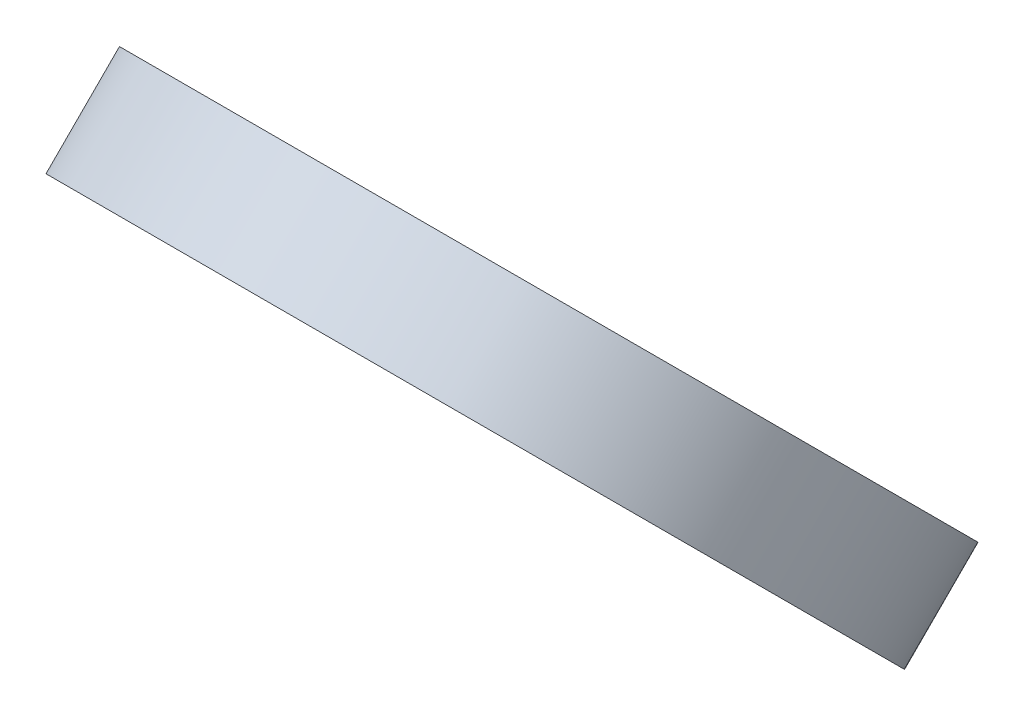
ISO-10303-21;
HEADER;
FILE_DESCRIPTION(('STEP AP214'),'2;1');
FILE_NAME('part.step','',(''),(''),'','','');
FILE_SCHEMA(('AUTOMOTIVE_DESIGN { 1 0 10303 214 1 1 1 1 }'));
ENDSEC;
DATA;
#1=APPLICATION_CONTEXT('core data for automotive mechanical design processes');
#2=APPLICATION_PROTOCOL_DEFINITION('international standard','automotive_design',2000,#1);
#3=PRODUCT_CONTEXT('',#1,'mechanical');
#4=PRODUCT('Part','Part','',(#3));
#5=PRODUCT_RELATED_PRODUCT_CATEGORY('part','',(#4));
#6=PRODUCT_DEFINITION_FORMATION('','',#4);
#7=PRODUCT_DEFINITION_CONTEXT('part definition',#1,'design');
#8=PRODUCT_DEFINITION('design','',#6,#7);
#9=PRODUCT_DEFINITION_SHAPE('','',#8);
#10=(LENGTH_UNIT() NAMED_UNIT(*) SI_UNIT(.MILLI.,.METRE.));
#11=(NAMED_UNIT(*) PLANE_ANGLE_UNIT() SI_UNIT($,.RADIAN.));
#12=(NAMED_UNIT(*) SI_UNIT($,.STERADIAN.) SOLID_ANGLE_UNIT());
#13=UNCERTAINTY_MEASURE_WITH_UNIT(LENGTH_MEASURE(1.E-05),#10,'distance_accuracy_value','');
#14=(GEOMETRIC_REPRESENTATION_CONTEXT(3) GLOBAL_UNCERTAINTY_ASSIGNED_CONTEXT((#13)) GLOBAL_UNIT_ASSIGNED_CONTEXT((#10,
#11,#12)) REPRESENTATION_CONTEXT('',''));
#15=CARTESIAN_POINT('',(0.,0.,0.));
#16=DIRECTION('',(0.,0.,1.));
#17=DIRECTION('',(1.,0.,0.));
#18=AXIS2_PLACEMENT_3D('',#15,#16,#17);
#19=CARTESIAN_POINT('',(0.,-143.365899885575,143.365899885573));
#20=DIRECTION('',(0.,0.707106781186544,-0.707106781186552));
#21=DIRECTION('',(0.,0.707106781186552,0.707106781186544));
#22=AXIS2_PLACEMENT_3D('',#19,#20,#21);
#23=PLANE('',#22);
#24=CARTESIAN_POINT('',(0.,33.4107954110648,320.142595182211));
#25=DIRECTION('',(0.,0.707106781186544,-0.707106781186552));
#26=DIRECTION('',(0.,0.707106781186552,0.707106781186544));
#27=AXIS2_PLACEMENT_3D('',#24,#25,#26);
#28=CIRCLE('',#27,13.4999999999988);
#29=CARTESIAN_POINT('',(0.,42.9567369570824,329.688536728228));
#30=VERTEX_POINT('',#29);
#31=EDGE_CURVE('E10',#30,#30,#28,.T.);
#32=ORIENTED_EDGE('',*,*,#31,.T.);
#33=EDGE_LOOP('',(#32));
#34=FACE_BOUND('',#33,.T.);
#35=CARTESIAN_POINT('',(0.,33.4107954110647,320.142595182211));
#36=DIRECTION('',(0.,0.707106781186544,-0.707106781186552));
#37=DIRECTION('',(0.,0.707106781186552,0.707106781186544));
#38=AXIS2_PLACEMENT_3D('',#35,#36,#37);
#39=CIRCLE('',#38,12.4999999999988);
#40=CARTESIAN_POINT('',(0.,42.2496301758958,328.981429947042));
#41=VERTEX_POINT('',#40);
#42=EDGE_CURVE('E47',#41,#41,#39,.T.);
#43=ORIENTED_EDGE('',*,*,#42,.F.);
#44=EDGE_LOOP('',(#43));
#45=FACE_BOUND('',#44,.T.);
#46=ADVANCED_FACE('F33',(#34,#45),#23,.T.);
#47=CARTESIAN_POINT('',(0.,176.776695296637,176.776695296637));
#48=DIRECTION('',(0.,0.707106781186544,-0.707106781186552));
#49=DIRECTION('',(0.,0.707106781186552,0.707106781186544));
#50=AXIS2_PLACEMENT_3D('',#47,#48,#49);
#51=CYLINDRICAL_SURFACE('',#50,13.4999999999988);
#52=CARTESIAN_POINT('',(0.,30.5823682863186,322.971022306957));
#53=DIRECTION('',(0.,0.707106781186544,-0.707106781186552));
#54=DIRECTION('',(0.,0.707106781186552,0.707106781186544));
#55=AXIS2_PLACEMENT_3D('',#52,#53,#54);
#56=CIRCLE('',#55,13.4999999999989);
#57=CARTESIAN_POINT('',(0.,40.1283098323362,332.516963852974));
#58=VERTEX_POINT('',#57);
#59=EDGE_CURVE('E39',#58,#58,#56,.T.);
#60=ORIENTED_EDGE('',*,*,#59,.T.);
#61=EDGE_LOOP('',(#60));
#62=FACE_BOUND('',#61,.T.);
#63=ORIENTED_EDGE('',*,*,#31,.F.);
#64=EDGE_LOOP('',(#63));
#65=FACE_BOUND('',#64,.T.);
#66=ADVANCED_FACE('F57',(#62,#65),#51,.T.);
#67=CARTESIAN_POINT('',(0.,-146.194327010323,146.194327010317));
#68=DIRECTION('',(0.,0.707106781186544,-0.707106781186552));
#69=DIRECTION('',(0.,0.707106781186552,0.707106781186544));
#70=AXIS2_PLACEMENT_3D('',#67,#68,#69);
#71=PLANE('',#70);
#72=ORIENTED_EDGE('',*,*,#59,.F.);
#73=EDGE_LOOP('',(#72));
#74=FACE_BOUND('',#73,.T.);
#75=CARTESIAN_POINT('',(0.,30.5823682863186,322.971022306957));
#76=DIRECTION('',(0.,0.707106781186544,-0.707106781186552));
#77=DIRECTION('',(0.,0.707106781186552,0.707106781186544));
#78=AXIS2_PLACEMENT_3D('',#75,#76,#77);
#79=CIRCLE('',#78,12.4999999999989);
#80=CARTESIAN_POINT('',(0.,39.4212030511497,331.809857071788));
#81=VERTEX_POINT('',#80);
#82=EDGE_CURVE('E43',#81,#81,#79,.T.);
#83=ORIENTED_EDGE('',*,*,#82,.T.);
#84=EDGE_LOOP('',(#83));
#85=FACE_BOUND('',#84,.T.);
#86=ADVANCED_FACE('F61',(#74,#85),#71,.F.);
#87=CARTESIAN_POINT('',(0.,176.776695296637,176.776695296637));
#88=DIRECTION('',(0.,0.707106781186544,-0.707106781186552));
#89=DIRECTION('',(0.,0.707106781186552,0.707106781186544));
#90=AXIS2_PLACEMENT_3D('',#87,#88,#89);
#91=CYLINDRICAL_SURFACE('',#90,12.4999999999989);
#92=ORIENTED_EDGE('',*,*,#42,.T.);
#93=EDGE_LOOP('',(#92));
#94=FACE_BOUND('',#93,.T.);
#95=ORIENTED_EDGE('',*,*,#82,.F.);
#96=EDGE_LOOP('',(#95));
#97=FACE_BOUND('',#96,.T.);
#98=ADVANCED_FACE('F53',(#94,#97),#91,.F.);
#99=CLOSED_SHELL('',(#46,#66,#86,#98));
#100=MANIFOLD_SOLID_BREP('B2',#99);
#101=ADVANCED_BREP_SHAPE_REPRESENTATION('',(#18,#100),#14);
#102=SHAPE_DEFINITION_REPRESENTATION(#9,#101);
ENDSEC;
END-ISO-10303-21;
